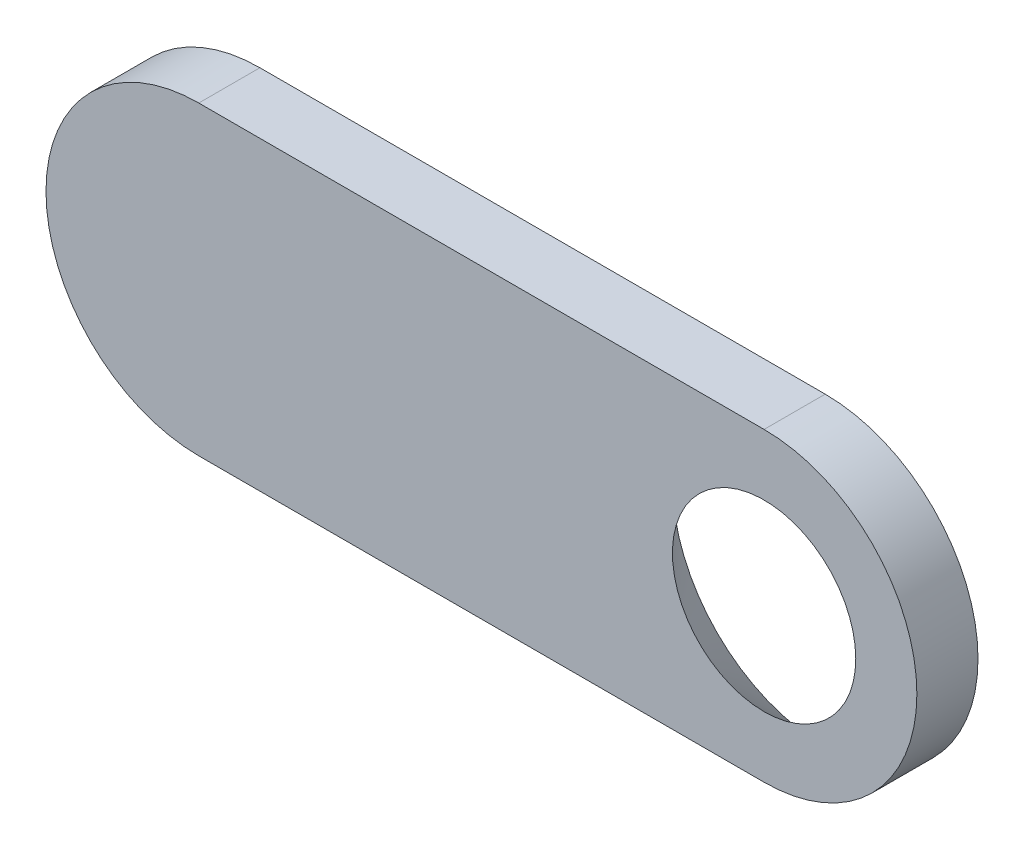
ISO-10303-21;
HEADER;
FILE_DESCRIPTION(('STEP AP214'),'2;1');
FILE_NAME('part.step','',(''),(''),'','','');
FILE_SCHEMA(('AUTOMOTIVE_DESIGN { 1 0 10303 214 1 1 1 1 }'));
ENDSEC;
DATA;
#1=APPLICATION_CONTEXT('core data for automotive mechanical design processes');
#2=APPLICATION_PROTOCOL_DEFINITION('international standard','automotive_design',2000,#1);
#3=PRODUCT_CONTEXT('',#1,'mechanical');
#4=PRODUCT('Part','Part','',(#3));
#5=PRODUCT_RELATED_PRODUCT_CATEGORY('part','',(#4));
#6=PRODUCT_DEFINITION_FORMATION('','',#4);
#7=PRODUCT_DEFINITION_CONTEXT('part definition',#1,'design');
#8=PRODUCT_DEFINITION('design','',#6,#7);
#9=PRODUCT_DEFINITION_SHAPE('','',#8);
#10=(LENGTH_UNIT() NAMED_UNIT(*) SI_UNIT(.MILLI.,.METRE.));
#11=(NAMED_UNIT(*) PLANE_ANGLE_UNIT() SI_UNIT($,.RADIAN.));
#12=(NAMED_UNIT(*) SI_UNIT($,.STERADIAN.) SOLID_ANGLE_UNIT());
#13=UNCERTAINTY_MEASURE_WITH_UNIT(LENGTH_MEASURE(1.E-05),#10,'distance_accuracy_value','');
#14=(GEOMETRIC_REPRESENTATION_CONTEXT(3) GLOBAL_UNCERTAINTY_ASSIGNED_CONTEXT((#13)) GLOBAL_UNIT_ASSIGNED_CONTEXT((#10,
#11,#12)) REPRESENTATION_CONTEXT('',''));
#15=CARTESIAN_POINT('',(0.,0.,0.));
#16=DIRECTION('',(0.,0.,1.));
#17=DIRECTION('',(1.,0.,0.));
#18=AXIS2_PLACEMENT_3D('',#15,#16,#17);
#19=CARTESIAN_POINT('',(34.,0.,2.));
#20=DIRECTION('',(0.,0.,1.));
#21=DIRECTION('',(1.,0.,0.));
#22=AXIS2_PLACEMENT_3D('',#19,#20,#21);
#23=PLANE('',#22);
#24=CARTESIAN_POINT('',(34.,0.,2.));
#25=DIRECTION('',(0.,0.,1.));
#26=DIRECTION('',(1.,0.,0.));
#27=AXIS2_PLACEMENT_3D('',#24,#25,#26);
#28=CIRCLE('',#27,5.);
#29=CARTESIAN_POINT('',(34.,-5.,2.));
#30=VERTEX_POINT('',#29);
#31=CARTESIAN_POINT('',(34.,5.,2.));
#32=VERTEX_POINT('',#31);
#33=EDGE_CURVE('E91',#30,#32,#28,.T.);
#34=ORIENTED_EDGE('',*,*,#33,.T.);
#35=DIRECTION('',(-1.,0.,0.));
#36=VECTOR('',#35,1.);
#37=CARTESIAN_POINT('',(15.5,5.,2.));
#38=LINE('',#37,#36);
#39=CARTESIAN_POINT('',(15.5,5.,2.));
#40=VERTEX_POINT('',#39);
#41=EDGE_CURVE('E86',#32,#40,#38,.T.);
#42=ORIENTED_EDGE('',*,*,#41,.T.);
#43=CARTESIAN_POINT('',(15.5,0.,2.));
#44=DIRECTION('',(0.,0.,1.));
#45=DIRECTION('',(1.,0.,0.));
#46=AXIS2_PLACEMENT_3D('',#43,#44,#45);
#47=CIRCLE('',#46,5.);
#48=CARTESIAN_POINT('',(15.5,-5.00000000000001,2.));
#49=VERTEX_POINT('',#48);
#50=EDGE_CURVE('E89',#40,#49,#47,.T.);
#51=ORIENTED_EDGE('',*,*,#50,.T.);
#52=DIRECTION('',(1.,0.,0.));
#53=VECTOR('',#52,1.);
#54=CARTESIAN_POINT('',(34.,-5.,2.));
#55=LINE('',#54,#53);
#56=EDGE_CURVE('E55',#49,#30,#55,.T.);
#57=ORIENTED_EDGE('',*,*,#56,.T.);
#58=EDGE_LOOP('',(#34,#42,#51,#57));
#59=FACE_BOUND('',#58,.T.);
#60=CARTESIAN_POINT('',(34.,0.,2.));
#61=DIRECTION('',(0.,0.,1.));
#62=DIRECTION('',(1.,0.,0.));
#63=AXIS2_PLACEMENT_3D('',#60,#61,#62);
#64=CIRCLE('',#63,3.00000000000001);
#65=CARTESIAN_POINT('',(37.,0.,2.));
#66=VERTEX_POINT('',#65);
#67=EDGE_CURVE('E106',#66,#66,#64,.T.);
#68=ORIENTED_EDGE('',*,*,#67,.F.);
#69=EDGE_LOOP('',(#68));
#70=FACE_BOUND('',#69,.T.);
#71=ADVANCED_FACE('F38',(#59,#70),#23,.T.);
#72=CARTESIAN_POINT('',(34.,0.,0.));
#73=DIRECTION('',(0.,0.,1.));
#74=DIRECTION('',(1.,0.,0.));
#75=AXIS2_PLACEMENT_3D('',#72,#73,#74);
#76=PLANE('',#75);
#77=DIRECTION('',(-1.,0.,0.));
#78=VECTOR('',#77,1.);
#79=CARTESIAN_POINT('',(15.5,5.,0.));
#80=LINE('',#79,#78);
#81=CARTESIAN_POINT('',(34.,5.,0.));
#82=VERTEX_POINT('',#81);
#83=CARTESIAN_POINT('',(15.5,5.,0.));
#84=VERTEX_POINT('',#83);
#85=EDGE_CURVE('E96',#82,#84,#80,.T.);
#86=ORIENTED_EDGE('',*,*,#85,.F.);
#87=CARTESIAN_POINT('',(34.,0.,0.));
#88=DIRECTION('',(0.,0.,1.));
#89=DIRECTION('',(1.,0.,0.));
#90=AXIS2_PLACEMENT_3D('',#87,#88,#89);
#91=CIRCLE('',#90,5.);
#92=CARTESIAN_POINT('',(34.,-5.,0.));
#93=VERTEX_POINT('',#92);
#94=EDGE_CURVE('E11',#82,#93,#91,.T.);
#95=ORIENTED_EDGE('',*,*,#94,.T.);
#96=DIRECTION('',(1.,0.,0.));
#97=VECTOR('',#96,1.);
#98=CARTESIAN_POINT('',(34.,-5.,0.));
#99=LINE('',#98,#97);
#100=CARTESIAN_POINT('',(15.5,-5.00000000000001,0.));
#101=VERTEX_POINT('',#100);
#102=EDGE_CURVE('E109',#101,#93,#99,.T.);
#103=ORIENTED_EDGE('',*,*,#102,.F.);
#104=CARTESIAN_POINT('',(15.5,0.,0.));
#105=DIRECTION('',(0.,0.,1.));
#106=DIRECTION('',(1.,0.,0.));
#107=AXIS2_PLACEMENT_3D('',#104,#105,#106);
#108=CIRCLE('',#107,5.);
#109=EDGE_CURVE('E72',#84,#101,#108,.T.);
#110=ORIENTED_EDGE('',*,*,#109,.F.);
#111=EDGE_LOOP('',(#86,#95,#103,#110));
#112=FACE_BOUND('',#111,.T.);
#113=ADVANCED_FACE('F118',(#112),#76,.F.);
#114=CARTESIAN_POINT('',(34.,0.,2.));
#115=DIRECTION('',(0.,0.,-1.));
#116=DIRECTION('',(-1.,0.,0.));
#117=AXIS2_PLACEMENT_3D('',#114,#115,#116);
#118=CYLINDRICAL_SURFACE('',#117,5.);
#119=CARTESIAN_POINT('',(34.,0.,0.));
#120=DIRECTION('',(0.,0.,1.));
#121=DIRECTION('',(1.,0.,0.));
#122=AXIS2_PLACEMENT_3D('',#119,#120,#121);
#123=CIRCLE('',#122,5.);
#124=EDGE_CURVE('E79',#93,#82,#123,.T.);
#125=ORIENTED_EDGE('',*,*,#124,.T.);
#126=DIRECTION('',(0.,0.,-1.));
#127=VECTOR('',#126,1.);
#128=CARTESIAN_POINT('',(34.,5.,2.));
#129=LINE('',#128,#127);
#130=EDGE_CURVE('E47',#32,#82,#129,.T.);
#131=ORIENTED_EDGE('',*,*,#130,.F.);
#132=ORIENTED_EDGE('',*,*,#33,.F.);
#133=DIRECTION('',(0.,0.,-1.));
#134=VECTOR('',#133,1.);
#135=CARTESIAN_POINT('',(34.,-5.,2.));
#136=LINE('',#135,#134);
#137=EDGE_CURVE('E101',#30,#93,#136,.T.);
#138=ORIENTED_EDGE('',*,*,#137,.T.);
#139=EDGE_LOOP('',(#125,#131,#132,#138));
#140=FACE_BOUND('',#139,.T.);
#141=ADVANCED_FACE('F115',(#140),#118,.T.);
#142=CARTESIAN_POINT('',(15.5,5.,2.));
#143=DIRECTION('',(0.,-1.,0.));
#144=DIRECTION('',(0.,0.,-1.));
#145=AXIS2_PLACEMENT_3D('',#142,#143,#144);
#146=PLANE('',#145);
#147=ORIENTED_EDGE('',*,*,#85,.T.);
#148=DIRECTION('',(0.,0.,-1.));
#149=VECTOR('',#148,1.);
#150=CARTESIAN_POINT('',(15.5,5.,2.));
#151=LINE('',#150,#149);
#152=EDGE_CURVE('E94',#40,#84,#151,.T.);
#153=ORIENTED_EDGE('',*,*,#152,.F.);
#154=ORIENTED_EDGE('',*,*,#41,.F.);
#155=ORIENTED_EDGE('',*,*,#130,.T.);
#156=EDGE_LOOP('',(#147,#153,#154,#155));
#157=FACE_BOUND('',#156,.T.);
#158=ADVANCED_FACE('F95',(#157),#146,.F.);
#159=CARTESIAN_POINT('',(15.5,0.,2.));
#160=DIRECTION('',(0.,0.,-1.));
#161=DIRECTION('',(-1.,0.,0.));
#162=AXIS2_PLACEMENT_3D('',#159,#160,#161);
#163=CYLINDRICAL_SURFACE('',#162,5.);
#164=ORIENTED_EDGE('',*,*,#109,.T.);
#165=DIRECTION('',(0.,0.,-1.));
#166=VECTOR('',#165,1.);
#167=CARTESIAN_POINT('',(15.5,-5.00000000000001,2.));
#168=LINE('',#167,#166);
#169=EDGE_CURVE('E97',#49,#101,#168,.T.);
#170=ORIENTED_EDGE('',*,*,#169,.F.);
#171=ORIENTED_EDGE('',*,*,#50,.F.);
#172=ORIENTED_EDGE('',*,*,#152,.T.);
#173=EDGE_LOOP('',(#164,#170,#171,#172));
#174=FACE_BOUND('',#173,.T.);
#175=ADVANCED_FACE('F99',(#174),#163,.T.);
#176=CARTESIAN_POINT('',(34.,-5.,2.));
#177=DIRECTION('',(0.,1.,0.));
#178=DIRECTION('',(-1.,0.,0.));
#179=AXIS2_PLACEMENT_3D('',#176,#177,#178);
#180=PLANE('',#179);
#181=ORIENTED_EDGE('',*,*,#102,.T.);
#182=ORIENTED_EDGE('',*,*,#137,.F.);
#183=ORIENTED_EDGE('',*,*,#56,.F.);
#184=ORIENTED_EDGE('',*,*,#169,.T.);
#185=EDGE_LOOP('',(#181,#182,#183,#184));
#186=FACE_BOUND('',#185,.T.);
#187=ADVANCED_FACE('F120',(#186),#180,.F.);
#188=CARTESIAN_POINT('',(34.,0.,0.));
#189=DIRECTION('',(0.,0.,-1.));
#190=DIRECTION('',(-1.,0.,0.));
#191=AXIS2_PLACEMENT_3D('',#188,#189,#190);
#192=CONICAL_SURFACE('',#191,5.,0.785398163397446);
#193=ORIENTED_EDGE('',*,*,#67,.T.);
#194=EDGE_LOOP('',(#193));
#195=FACE_BOUND('',#194,.T.);
#196=ORIENTED_EDGE('',*,*,#124,.F.);
#197=ORIENTED_EDGE('',*,*,#94,.F.);
#198=EDGE_LOOP('',(#196,#197));
#199=FACE_BOUND('',#198,.T.);
#200=ADVANCED_FACE('F40',(#195,#199),#192,.F.);
#201=CLOSED_SHELL('',(#71,#113,#141,#158,#175,#187,#200));
#202=MANIFOLD_SOLID_BREP('B2',#201);
#203=ADVANCED_BREP_SHAPE_REPRESENTATION('',(#18,#202),#14);
#204=SHAPE_DEFINITION_REPRESENTATION(#9,#203);
ENDSEC;
END-ISO-10303-21;
